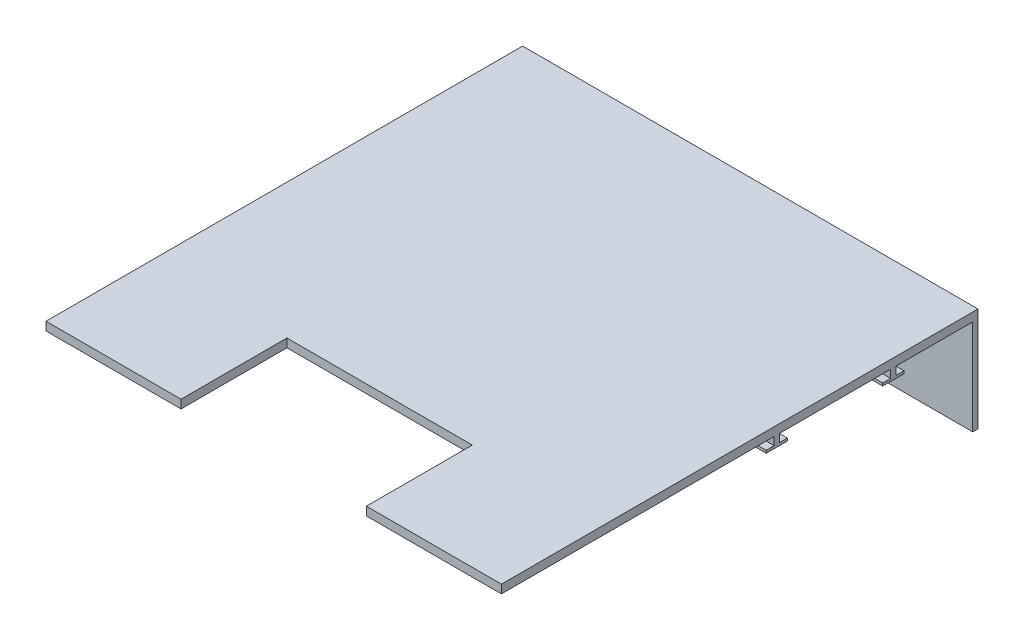
ISO-10303-21;
HEADER;
FILE_DESCRIPTION(('STEP AP214'),'2;1');
FILE_NAME('part.step','',(''),(''),'','','');
FILE_SCHEMA(('AUTOMOTIVE_DESIGN { 1 0 10303 214 1 1 1 1 }'));
ENDSEC;
DATA;
#1=APPLICATION_CONTEXT('core data for automotive mechanical design processes');
#2=APPLICATION_PROTOCOL_DEFINITION('international standard','automotive_design',2000,#1);
#3=PRODUCT_CONTEXT('',#1,'mechanical');
#4=PRODUCT('Part','Part','',(#3));
#5=PRODUCT_RELATED_PRODUCT_CATEGORY('part','',(#4));
#6=PRODUCT_DEFINITION_FORMATION('','',#4);
#7=PRODUCT_DEFINITION_CONTEXT('part definition',#1,'design');
#8=PRODUCT_DEFINITION('design','',#6,#7);
#9=PRODUCT_DEFINITION_SHAPE('','',#8);
#10=(LENGTH_UNIT() NAMED_UNIT(*) SI_UNIT(.MILLI.,.METRE.));
#11=(NAMED_UNIT(*) PLANE_ANGLE_UNIT() SI_UNIT($,.RADIAN.));
#12=(NAMED_UNIT(*) SI_UNIT($,.STERADIAN.) SOLID_ANGLE_UNIT());
#13=UNCERTAINTY_MEASURE_WITH_UNIT(LENGTH_MEASURE(1.E-05),#10,'distance_accuracy_value','');
#14=(GEOMETRIC_REPRESENTATION_CONTEXT(3) GLOBAL_UNCERTAINTY_ASSIGNED_CONTEXT((#13)) GLOBAL_UNIT_ASSIGNED_CONTEXT((#10,
#11,#12)) REPRESENTATION_CONTEXT('',''));
#15=CARTESIAN_POINT('',(0.,0.,0.));
#16=DIRECTION('',(0.,0.,1.));
#17=DIRECTION('',(1.,0.,0.));
#18=AXIS2_PLACEMENT_3D('',#15,#16,#17);
#19=CARTESIAN_POINT('',(0.,0.,0.));
#20=DIRECTION('',(0.,-1.,0.));
#21=DIRECTION('',(0.,0.,-1.));
#22=AXIS2_PLACEMENT_3D('',#19,#20,#21);
#23=PLANE('',#22);
#24=DIRECTION('',(-1.,0.,0.));
#25=VECTOR('',#24,1.);
#26=CARTESIAN_POINT('',(0.,0.,-262.5));
#27=LINE('',#26,#25);
#28=CARTESIAN_POINT('',(430.,0.,-262.5));
#29=VERTEX_POINT('',#28);
#30=CARTESIAN_POINT('',(0.,0.,-262.5));
#31=VERTEX_POINT('',#30);
#32=EDGE_CURVE('E50',#29,#31,#27,.T.);
#33=ORIENTED_EDGE('',*,*,#32,.T.);
#34=DIRECTION('',(0.,0.,1.));
#35=VECTOR('',#34,1.);
#36=CARTESIAN_POINT('',(0.,0.,0.));
#37=LINE('',#36,#35);
#38=CARTESIAN_POINT('',(0.,0.,-367.5));
#39=VERTEX_POINT('',#38);
#40=EDGE_CURVE('E388',#39,#31,#37,.T.);
#41=ORIENTED_EDGE('',*,*,#40,.F.);
#42=DIRECTION('',(-1.,0.,0.));
#43=VECTOR('',#42,1.);
#44=CARTESIAN_POINT('',(0.,0.,-367.5));
#45=LINE('',#44,#43);
#46=CARTESIAN_POINT('',(430.,0.,-367.5));
#47=VERTEX_POINT('',#46);
#48=EDGE_CURVE('E308',#47,#39,#45,.T.);
#49=ORIENTED_EDGE('',*,*,#48,.F.);
#50=DIRECTION('',(0.,0.,-1.));
#51=VECTOR('',#50,1.);
#52=CARTESIAN_POINT('',(430.,0.,0.));
#53=LINE('',#52,#51);
#54=EDGE_CURVE('E394',#29,#47,#53,.T.);
#55=ORIENTED_EDGE('',*,*,#54,.F.);
#56=EDGE_LOOP('',(#33,#41,#49,#55));
#57=FACE_BOUND('',#56,.T.);
#58=ADVANCED_FACE('F35',(#57),#23,.T.);
#59=CARTESIAN_POINT('',(430.,0.,-372.5));
#60=VERTEX_POINT('',#59);
#61=CARTESIAN_POINT('',(430.,0.,-445.));
#62=VERTEX_POINT('',#61);
#63=EDGE_CURVE('E392',#60,#62,#53,.T.);
#64=ORIENTED_EDGE('',*,*,#63,.F.);
#65=DIRECTION('',(1.,0.,0.));
#66=VECTOR('',#65,1.);
#67=CARTESIAN_POINT('',(0.,0.,-372.5));
#68=LINE('',#67,#66);
#69=CARTESIAN_POINT('',(0.,0.,-372.5));
#70=VERTEX_POINT('',#69);
#71=EDGE_CURVE('E303',#70,#60,#68,.T.);
#72=ORIENTED_EDGE('',*,*,#71,.F.);
#73=CARTESIAN_POINT('',(0.,0.,-445.));
#74=VERTEX_POINT('',#73);
#75=EDGE_CURVE('E384',#74,#70,#37,.T.);
#76=ORIENTED_EDGE('',*,*,#75,.F.);
#77=DIRECTION('',(-1.,0.,0.));
#78=VECTOR('',#77,1.);
#79=CARTESIAN_POINT('',(5.00062614380899,0.,-445.));
#80=LINE('',#79,#78);
#81=EDGE_CURVE('E322',#62,#74,#80,.T.);
#82=ORIENTED_EDGE('',*,*,#81,.F.);
#83=EDGE_LOOP('',(#64,#72,#76,#82));
#84=FACE_BOUND('',#83,.T.);
#85=ADVANCED_FACE('F457',(#84),#23,.T.);
#86=DIRECTION('',(1.,0.,0.));
#87=VECTOR('',#86,1.);
#88=CARTESIAN_POINT('',(0.,0.,-257.5));
#89=LINE('',#88,#87);
#90=CARTESIAN_POINT('',(0.,0.,-257.5));
#91=VERTEX_POINT('',#90);
#92=CARTESIAN_POINT('',(430.,0.,-257.5));
#93=VERTEX_POINT('',#92);
#94=EDGE_CURVE('E257',#91,#93,#89,.T.);
#95=ORIENTED_EDGE('',*,*,#94,.T.);
#96=CARTESIAN_POINT('',(430.,0.,0.));
#97=VERTEX_POINT('',#96);
#98=EDGE_CURVE('E375',#97,#93,#53,.T.);
#99=ORIENTED_EDGE('',*,*,#98,.F.);
#100=DIRECTION('',(1.,0.,0.));
#101=VECTOR('',#100,1.);
#102=CARTESIAN_POINT('',(0.,0.,0.));
#103=LINE('',#102,#101);
#104=CARTESIAN_POINT('',(302.5,0.,0.));
#105=VERTEX_POINT('',#104);
#106=EDGE_CURVE('E387',#105,#97,#103,.T.);
#107=ORIENTED_EDGE('',*,*,#106,.F.);
#108=DIRECTION('',(0.,0.,1.));
#109=VECTOR('',#108,1.);
#110=CARTESIAN_POINT('',(302.5,0.,0.));
#111=LINE('',#110,#109);
#112=CARTESIAN_POINT('',(302.5,0.,-100.));
#113=VERTEX_POINT('',#112);
#114=EDGE_CURVE('E404',#113,#105,#111,.T.);
#115=ORIENTED_EDGE('',*,*,#114,.F.);
#116=DIRECTION('',(1.,0.,0.));
#117=VECTOR('',#116,1.);
#118=CARTESIAN_POINT('',(0.,0.,-100.));
#119=LINE('',#118,#117);
#120=CARTESIAN_POINT('',(127.5,0.,-100.));
#121=VERTEX_POINT('',#120);
#122=EDGE_CURVE('E43',#121,#113,#119,.T.);
#123=ORIENTED_EDGE('',*,*,#122,.F.);
#124=DIRECTION('',(0.,0.,-1.));
#125=VECTOR('',#124,1.);
#126=CARTESIAN_POINT('',(127.5,0.,0.));
#127=LINE('',#126,#125);
#128=CARTESIAN_POINT('',(127.5,0.,0.));
#129=VERTEX_POINT('',#128);
#130=EDGE_CURVE('E11',#129,#121,#127,.T.);
#131=ORIENTED_EDGE('',*,*,#130,.F.);
#132=CARTESIAN_POINT('',(0.,0.,0.));
#133=VERTEX_POINT('',#132);
#134=EDGE_CURVE('E389',#133,#129,#103,.T.);
#135=ORIENTED_EDGE('',*,*,#134,.F.);
#136=EDGE_CURVE('E364',#91,#133,#37,.T.);
#137=ORIENTED_EDGE('',*,*,#136,.F.);
#138=EDGE_LOOP('',(#95,#99,#107,#115,#123,#131,#135,#137));
#139=FACE_BOUND('',#138,.T.);
#140=CARTESIAN_POINT('',(400.,0.,-217.));
#141=DIRECTION('',(0.,-1.,0.));
#142=DIRECTION('',(0.,0.,1.));
#143=AXIS2_PLACEMENT_3D('',#140,#141,#142);
#144=CIRCLE('',#143,3.49999999999996);
#145=CARTESIAN_POINT('',(400.,0.,-213.5));
#146=VERTEX_POINT('',#145);
#147=EDGE_CURVE('E341',#146,#146,#144,.T.);
#148=ORIENTED_EDGE('',*,*,#147,.F.);
#149=EDGE_LOOP('',(#148));
#150=FACE_BOUND('',#149,.T.);
#151=CARTESIAN_POINT('',(30.,0.,-217.));
#152=DIRECTION('',(0.,-1.,0.));
#153=DIRECTION('',(0.,0.,-1.));
#154=AXIS2_PLACEMENT_3D('',#151,#152,#153);
#155=CIRCLE('',#154,3.5);
#156=CARTESIAN_POINT('',(30.,0.,-220.5));
#157=VERTEX_POINT('',#156);
#158=EDGE_CURVE('E345',#157,#157,#155,.T.);
#159=ORIENTED_EDGE('',*,*,#158,.F.);
#160=EDGE_LOOP('',(#159));
#161=FACE_BOUND('',#160,.T.);
#162=ADVANCED_FACE('F414',(#139,#150,#161),#23,.T.);
#163=CARTESIAN_POINT('',(0.,8.,0.));
#164=DIRECTION('',(0.,0.,-1.));
#165=DIRECTION('',(-1.,0.,0.));
#166=AXIS2_PLACEMENT_3D('',#163,#164,#165);
#167=PLANE('',#166);
#168=ORIENTED_EDGE('',*,*,#134,.T.);
#169=DIRECTION('',(0.,1.,0.));
#170=VECTOR('',#169,1.);
#171=CARTESIAN_POINT('',(127.5,-2.,0.));
#172=LINE('',#171,#170);
#173=CARTESIAN_POINT('',(127.5,8.,0.));
#174=VERTEX_POINT('',#173);
#175=EDGE_CURVE('E361',#129,#174,#172,.T.);
#176=ORIENTED_EDGE('',*,*,#175,.T.);
#177=DIRECTION('',(1.,0.,0.));
#178=VECTOR('',#177,1.);
#179=CARTESIAN_POINT('',(0.,8.,0.));
#180=LINE('',#179,#178);
#181=CARTESIAN_POINT('',(0.,8.,0.));
#182=VERTEX_POINT('',#181);
#183=EDGE_CURVE('E376',#182,#174,#180,.T.);
#184=ORIENTED_EDGE('',*,*,#183,.F.);
#185=DIRECTION('',(0.,-1.,0.));
#186=VECTOR('',#185,1.);
#187=CARTESIAN_POINT('',(0.,8.,0.));
#188=LINE('',#187,#186);
#189=EDGE_CURVE('E401',#182,#133,#188,.T.);
#190=ORIENTED_EDGE('',*,*,#189,.T.);
#191=EDGE_LOOP('',(#168,#176,#184,#190));
#192=FACE_BOUND('',#191,.T.);
#193=ADVANCED_FACE('F434',(#192),#167,.F.);
#194=CARTESIAN_POINT('',(0.,8.,0.));
#195=DIRECTION('',(1.,0.,0.));
#196=DIRECTION('',(0.,0.,-1.));
#197=AXIS2_PLACEMENT_3D('',#194,#195,#196);
#198=PLANE('',#197);
#199=DIRECTION('',(0.,-1.,0.));
#200=VECTOR('',#199,1.);
#201=CARTESIAN_POINT('',(0.,8.,-450.));
#202=LINE('',#201,#200);
#203=CARTESIAN_POINT('',(0.,8.,-450.));
#204=VERTEX_POINT('',#203);
#205=CARTESIAN_POINT('',(0.,-90.,-450.));
#206=VERTEX_POINT('',#205);
#207=EDGE_CURVE('E383',#204,#206,#202,.T.);
#208=ORIENTED_EDGE('',*,*,#207,.T.);
#209=DIRECTION('',(0.,0.,-1.));
#210=VECTOR('',#209,1.);
#211=CARTESIAN_POINT('',(0.,-90.,-445.));
#212=LINE('',#211,#210);
#213=CARTESIAN_POINT('',(0.,-90.,-445.));
#214=VERTEX_POINT('',#213);
#215=EDGE_CURVE('E328',#214,#206,#212,.T.);
#216=ORIENTED_EDGE('',*,*,#215,.F.);
#217=DIRECTION('',(0.,1.,0.));
#218=VECTOR('',#217,1.);
#219=CARTESIAN_POINT('',(0.,-90.,-445.));
#220=LINE('',#219,#218);
#221=EDGE_CURVE('E334',#214,#74,#220,.T.);
#222=ORIENTED_EDGE('',*,*,#221,.T.);
#223=ORIENTED_EDGE('',*,*,#75,.T.);
#224=DIRECTION('',(0.,1.,0.));
#225=VECTOR('',#224,1.);
#226=CARTESIAN_POINT('',(0.,-7.5,-372.5));
#227=LINE('',#226,#225);
#228=CARTESIAN_POINT('',(0.,-7.5,-372.5));
#229=VERTEX_POINT('',#228);
#230=EDGE_CURVE('E320',#229,#70,#227,.T.);
#231=ORIENTED_EDGE('',*,*,#230,.F.);
#232=DIRECTION('',(0.,0.,-1.));
#233=VECTOR('',#232,1.);
#234=CARTESIAN_POINT('',(0.,-7.5,-360.));
#235=LINE('',#234,#233);
#236=CARTESIAN_POINT('',(0.,-7.5,-380.));
#237=VERTEX_POINT('',#236);
#238=EDGE_CURVE('E287',#229,#237,#235,.T.);
#239=ORIENTED_EDGE('',*,*,#238,.T.);
#240=DIRECTION('',(0.,1.,0.));
#241=VECTOR('',#240,1.);
#242=CARTESIAN_POINT('',(0.,-10.,-380.));
#243=LINE('',#242,#241);
#244=CARTESIAN_POINT('',(0.,-10.,-380.));
#245=VERTEX_POINT('',#244);
#246=EDGE_CURVE('E294',#245,#237,#243,.T.);
#247=ORIENTED_EDGE('',*,*,#246,.F.);
#248=DIRECTION('',(0.,0.,-1.));
#249=VECTOR('',#248,1.);
#250=CARTESIAN_POINT('',(0.,-10.,-360.));
#251=LINE('',#250,#249);
#252=CARTESIAN_POINT('',(0.,-10.,-360.));
#253=VERTEX_POINT('',#252);
#254=EDGE_CURVE('E278',#253,#245,#251,.T.);
#255=ORIENTED_EDGE('',*,*,#254,.F.);
#256=DIRECTION('',(0.,1.,0.));
#257=VECTOR('',#256,1.);
#258=CARTESIAN_POINT('',(0.,-10.,-360.));
#259=LINE('',#258,#257);
#260=CARTESIAN_POINT('',(0.,-7.5,-360.));
#261=VERTEX_POINT('',#260);
#262=EDGE_CURVE('E297',#253,#261,#259,.T.);
#263=ORIENTED_EDGE('',*,*,#262,.T.);
#264=CARTESIAN_POINT('',(0.,-7.5,-367.5));
#265=VERTEX_POINT('',#264);
#266=EDGE_CURVE('E288',#261,#265,#235,.T.);
#267=ORIENTED_EDGE('',*,*,#266,.T.);
#268=DIRECTION('',(0.,1.,0.));
#269=VECTOR('',#268,1.);
#270=CARTESIAN_POINT('',(0.,-7.5,-367.5));
#271=LINE('',#270,#269);
#272=EDGE_CURVE('E311',#265,#39,#271,.T.);
#273=ORIENTED_EDGE('',*,*,#272,.T.);
#274=ORIENTED_EDGE('',*,*,#40,.T.);
#275=DIRECTION('',(0.,1.,0.));
#276=VECTOR('',#275,1.);
#277=CARTESIAN_POINT('',(0.,-7.5,-262.5));
#278=LINE('',#277,#276);
#279=CARTESIAN_POINT('',(0.,-7.5,-262.5));
#280=VERTEX_POINT('',#279);
#281=EDGE_CURVE('E269',#280,#31,#278,.T.);
#282=ORIENTED_EDGE('',*,*,#281,.F.);
#283=DIRECTION('',(0.,0.,1.));
#284=VECTOR('',#283,1.);
#285=CARTESIAN_POINT('',(0.,-7.5,-270.));
#286=LINE('',#285,#284);
#287=CARTESIAN_POINT('',(0.,-7.5,-270.));
#288=VERTEX_POINT('',#287);
#289=EDGE_CURVE('E245',#288,#280,#286,.T.);
#290=ORIENTED_EDGE('',*,*,#289,.F.);
#291=DIRECTION('',(0.,1.,0.));
#292=VECTOR('',#291,1.);
#293=CARTESIAN_POINT('',(0.,-10.,-270.));
#294=LINE('',#293,#292);
#295=CARTESIAN_POINT('',(0.,-10.,-270.));
#296=VERTEX_POINT('',#295);
#297=EDGE_CURVE('E250',#296,#288,#294,.T.);
#298=ORIENTED_EDGE('',*,*,#297,.F.);
#299=DIRECTION('',(0.,0.,1.));
#300=VECTOR('',#299,1.);
#301=CARTESIAN_POINT('',(0.,-10.,-270.));
#302=LINE('',#301,#300);
#303=CARTESIAN_POINT('',(0.,-10.,-250.));
#304=VERTEX_POINT('',#303);
#305=EDGE_CURVE('E234',#296,#304,#302,.T.);
#306=ORIENTED_EDGE('',*,*,#305,.T.);
#307=DIRECTION('',(0.,1.,0.));
#308=VECTOR('',#307,1.);
#309=CARTESIAN_POINT('',(0.,-10.,-250.));
#310=LINE('',#309,#308);
#311=CARTESIAN_POINT('',(0.,-7.5,-250.));
#312=VERTEX_POINT('',#311);
#313=EDGE_CURVE('E220',#304,#312,#310,.T.);
#314=ORIENTED_EDGE('',*,*,#313,.T.);
#315=CARTESIAN_POINT('',(0.,-7.5,-257.5));
#316=VERTEX_POINT('',#315);
#317=EDGE_CURVE('E244',#316,#312,#286,.T.);
#318=ORIENTED_EDGE('',*,*,#317,.F.);
#319=DIRECTION('',(0.,1.,0.));
#320=VECTOR('',#319,1.);
#321=CARTESIAN_POINT('',(0.,-7.5,-257.5));
#322=LINE('',#321,#320);
#323=EDGE_CURVE('E260',#316,#91,#322,.T.);
#324=ORIENTED_EDGE('',*,*,#323,.T.);
#325=ORIENTED_EDGE('',*,*,#136,.T.);
#326=ORIENTED_EDGE('',*,*,#189,.F.);
#327=DIRECTION('',(0.,0.,1.));
#328=VECTOR('',#327,1.);
#329=CARTESIAN_POINT('',(0.,8.,0.));
#330=LINE('',#329,#328);
#331=EDGE_CURVE('E371',#204,#182,#330,.T.);
#332=ORIENTED_EDGE('',*,*,#331,.F.);
#333=EDGE_LOOP('',(#208,#216,#222,#223,#231,#239,#247,#255,#263,#267,#273,#274,#282,#290,#298,
#306,#314,#318,#324,#325,#326,#332));
#334=FACE_BOUND('',#333,.T.);
#335=ADVANCED_FACE('F37',(#334),#198,.F.);
#336=CARTESIAN_POINT('',(302.5,8.,0.));
#337=VERTEX_POINT('',#336);
#338=CARTESIAN_POINT('',(430.,8.,0.));
#339=VERTEX_POINT('',#338);
#340=EDGE_CURVE('E374',#337,#339,#180,.T.);
#341=ORIENTED_EDGE('',*,*,#340,.F.);
#342=DIRECTION('',(0.,1.,0.));
#343=VECTOR('',#342,1.);
#344=CARTESIAN_POINT('',(302.5,-2.,0.));
#345=LINE('',#344,#343);
#346=EDGE_CURVE('E367',#105,#337,#345,.T.);
#347=ORIENTED_EDGE('',*,*,#346,.F.);
#348=ORIENTED_EDGE('',*,*,#106,.T.);
#349=DIRECTION('',(0.,-1.,0.));
#350=VECTOR('',#349,1.);
#351=CARTESIAN_POINT('',(430.,8.,0.));
#352=LINE('',#351,#350);
#353=EDGE_CURVE('E398',#339,#97,#352,.T.);
#354=ORIENTED_EDGE('',*,*,#353,.F.);
#355=EDGE_LOOP('',(#341,#347,#348,#354));
#356=FACE_BOUND('',#355,.T.);
#357=ADVANCED_FACE('F423',(#356),#167,.F.);
#358=CARTESIAN_POINT('',(430.,8.,0.));
#359=DIRECTION('',(-1.,0.,0.));
#360=DIRECTION('',(0.,0.,1.));
#361=AXIS2_PLACEMENT_3D('',#358,#359,#360);
#362=PLANE('',#361);
#363=ORIENTED_EDGE('',*,*,#98,.T.);
#364=DIRECTION('',(0.,1.,0.));
#365=VECTOR('',#364,1.);
#366=CARTESIAN_POINT('',(430.,-7.5,-257.5));
#367=LINE('',#366,#365);
#368=CARTESIAN_POINT('',(430.,-7.5,-257.5));
#369=VERTEX_POINT('',#368);
#370=EDGE_CURVE('E265',#369,#93,#367,.T.);
#371=ORIENTED_EDGE('',*,*,#370,.F.);
#372=DIRECTION('',(0.,0.,-1.));
#373=VECTOR('',#372,1.);
#374=CARTESIAN_POINT('',(430.,-7.5,-270.));
#375=LINE('',#374,#373);
#376=CARTESIAN_POINT('',(430.,-7.5,-250.));
#377=VERTEX_POINT('',#376);
#378=EDGE_CURVE('E215',#377,#369,#375,.T.);
#379=ORIENTED_EDGE('',*,*,#378,.F.);
#380=DIRECTION('',(0.,1.,0.));
#381=VECTOR('',#380,1.);
#382=CARTESIAN_POINT('',(430.,-10.,-250.));
#383=LINE('',#382,#381);
#384=CARTESIAN_POINT('',(430.,-10.,-250.));
#385=VERTEX_POINT('',#384);
#386=EDGE_CURVE('E207',#385,#377,#383,.T.);
#387=ORIENTED_EDGE('',*,*,#386,.F.);
#388=DIRECTION('',(0.,0.,-1.));
#389=VECTOR('',#388,1.);
#390=CARTESIAN_POINT('',(430.,-10.,-270.));
#391=LINE('',#390,#389);
#392=CARTESIAN_POINT('',(430.,-10.,-270.));
#393=VERTEX_POINT('',#392);
#394=EDGE_CURVE('E212',#385,#393,#391,.T.);
#395=ORIENTED_EDGE('',*,*,#394,.T.);
#396=DIRECTION('',(0.,1.,0.));
#397=VECTOR('',#396,1.);
#398=CARTESIAN_POINT('',(430.,-10.,-270.));
#399=LINE('',#398,#397);
#400=CARTESIAN_POINT('',(430.,-7.5,-270.));
#401=VERTEX_POINT('',#400);
#402=EDGE_CURVE('E239',#393,#401,#399,.T.);
#403=ORIENTED_EDGE('',*,*,#402,.T.);
#404=CARTESIAN_POINT('',(430.,-7.5,-262.5));
#405=VERTEX_POINT('',#404);
#406=EDGE_CURVE('E242',#405,#401,#375,.T.);
#407=ORIENTED_EDGE('',*,*,#406,.F.);
#408=DIRECTION('',(0.,1.,0.));
#409=VECTOR('',#408,1.);
#410=CARTESIAN_POINT('',(430.,-7.5,-262.5));
#411=LINE('',#410,#409);
#412=EDGE_CURVE('E267',#405,#29,#411,.T.);
#413=ORIENTED_EDGE('',*,*,#412,.T.);
#414=ORIENTED_EDGE('',*,*,#54,.T.);
#415=DIRECTION('',(0.,1.,0.));
#416=VECTOR('',#415,1.);
#417=CARTESIAN_POINT('',(430.,-7.5,-367.5));
#418=LINE('',#417,#416);
#419=CARTESIAN_POINT('',(430.,-7.5,-367.5));
#420=VERTEX_POINT('',#419);
#421=EDGE_CURVE('E316',#420,#47,#418,.T.);
#422=ORIENTED_EDGE('',*,*,#421,.F.);
#423=DIRECTION('',(0.,0.,1.));
#424=VECTOR('',#423,1.);
#425=CARTESIAN_POINT('',(430.,-7.5,-360.));
#426=LINE('',#425,#424);
#427=CARTESIAN_POINT('',(430.,-7.5,-360.));
#428=VERTEX_POINT('',#427);
#429=EDGE_CURVE('E271',#420,#428,#426,.T.);
#430=ORIENTED_EDGE('',*,*,#429,.T.);
#431=DIRECTION('',(0.,1.,0.));
#432=VECTOR('',#431,1.);
#433=CARTESIAN_POINT('',(430.,-10.,-360.));
#434=LINE('',#433,#432);
#435=CARTESIAN_POINT('',(430.,-10.,-360.));
#436=VERTEX_POINT('',#435);
#437=EDGE_CURVE('E300',#436,#428,#434,.T.);
#438=ORIENTED_EDGE('',*,*,#437,.F.);
#439=DIRECTION('',(0.,0.,1.));
#440=VECTOR('',#439,1.);
#441=CARTESIAN_POINT('',(430.,-10.,-360.));
#442=LINE('',#441,#440);
#443=CARTESIAN_POINT('',(430.,-10.,-380.));
#444=VERTEX_POINT('',#443);
#445=EDGE_CURVE('E272',#444,#436,#442,.T.);
#446=ORIENTED_EDGE('',*,*,#445,.F.);
#447=DIRECTION('',(0.,1.,0.));
#448=VECTOR('',#447,1.);
#449=CARTESIAN_POINT('',(430.,-10.,-380.));
#450=LINE('',#449,#448);
#451=CARTESIAN_POINT('',(430.,-7.5,-380.));
#452=VERTEX_POINT('',#451);
#453=EDGE_CURVE('E282',#444,#452,#450,.T.);
#454=ORIENTED_EDGE('',*,*,#453,.T.);
#455=CARTESIAN_POINT('',(430.,-7.5,-372.5));
#456=VERTEX_POINT('',#455);
#457=EDGE_CURVE('E283',#452,#456,#426,.T.);
#458=ORIENTED_EDGE('',*,*,#457,.T.);
#459=DIRECTION('',(0.,1.,0.));
#460=VECTOR('',#459,1.);
#461=CARTESIAN_POINT('',(430.,-7.5,-372.5));
#462=LINE('',#461,#460);
#463=EDGE_CURVE('E58',#456,#60,#462,.T.);
#464=ORIENTED_EDGE('',*,*,#463,.T.);
#465=ORIENTED_EDGE('',*,*,#63,.T.);
#466=DIRECTION('',(0.,1.,0.));
#467=VECTOR('',#466,1.);
#468=CARTESIAN_POINT('',(430.,-90.,-445.));
#469=LINE('',#468,#467);
#470=CARTESIAN_POINT('',(430.,-90.,-445.));
#471=VERTEX_POINT('',#470);
#472=EDGE_CURVE('E338',#471,#62,#469,.T.);
#473=ORIENTED_EDGE('',*,*,#472,.F.);
#474=DIRECTION('',(0.,0.,1.));
#475=VECTOR('',#474,1.);
#476=CARTESIAN_POINT('',(430.,-90.,-445.));
#477=LINE('',#476,#475);
#478=CARTESIAN_POINT('',(430.,-90.,-450.));
#479=VERTEX_POINT('',#478);
#480=EDGE_CURVE('E323',#479,#471,#477,.T.);
#481=ORIENTED_EDGE('',*,*,#480,.F.);
#482=DIRECTION('',(0.,-1.,0.));
#483=VECTOR('',#482,1.);
#484=CARTESIAN_POINT('',(430.,8.,-450.));
#485=LINE('',#484,#483);
#486=CARTESIAN_POINT('',(430.,8.,-450.));
#487=VERTEX_POINT('',#486);
#488=EDGE_CURVE('E396',#487,#479,#485,.T.);
#489=ORIENTED_EDGE('',*,*,#488,.F.);
#490=DIRECTION('',(0.,0.,-1.));
#491=VECTOR('',#490,1.);
#492=CARTESIAN_POINT('',(430.,8.,0.));
#493=LINE('',#492,#491);
#494=EDGE_CURVE('E379',#339,#487,#493,.T.);
#495=ORIENTED_EDGE('',*,*,#494,.F.);
#496=ORIENTED_EDGE('',*,*,#353,.T.);
#497=EDGE_LOOP('',(#363,#371,#379,#387,#395,#403,#407,#413,#414,#422,#430,#438,#446,#454,#458,
#464,#465,#473,#481,#489,#495,#496));
#498=FACE_BOUND('',#497,.T.);
#499=ADVANCED_FACE('F210',(#498),#362,.F.);
#500=CARTESIAN_POINT('',(0.,8.,-450.));
#501=DIRECTION('',(0.,0.,1.));
#502=DIRECTION('',(1.,0.,0.));
#503=AXIS2_PLACEMENT_3D('',#500,#501,#502);
#504=PLANE('',#503);
#505=ORIENTED_EDGE('',*,*,#488,.T.);
#506=DIRECTION('',(1.,0.,0.));
#507=VECTOR('',#506,1.);
#508=CARTESIAN_POINT('',(430.,-90.,-450.));
#509=LINE('',#508,#507);
#510=EDGE_CURVE('E331',#206,#479,#509,.T.);
#511=ORIENTED_EDGE('',*,*,#510,.F.);
#512=ORIENTED_EDGE('',*,*,#207,.F.);
#513=DIRECTION('',(-1.,0.,0.));
#514=VECTOR('',#513,1.);
#515=CARTESIAN_POINT('',(0.,8.,-450.));
#516=LINE('',#515,#514);
#517=EDGE_CURVE('E381',#487,#204,#516,.T.);
#518=ORIENTED_EDGE('',*,*,#517,.F.);
#519=EDGE_LOOP('',(#505,#511,#512,#518));
#520=FACE_BOUND('',#519,.T.);
#521=ADVANCED_FACE('F466',(#520),#504,.F.);
#522=CARTESIAN_POINT('',(0.,8.,0.));
#523=DIRECTION('',(0.,-1.,0.));
#524=DIRECTION('',(0.,0.,-1.));
#525=AXIS2_PLACEMENT_3D('',#522,#523,#524);
#526=PLANE('',#525);
#527=ORIENTED_EDGE('',*,*,#183,.T.);
#528=DIRECTION('',(0.,0.,1.));
#529=VECTOR('',#528,1.);
#530=CARTESIAN_POINT('',(127.5,8.,0.));
#531=LINE('',#530,#529);
#532=CARTESIAN_POINT('',(127.5,8.,-100.));
#533=VERTEX_POINT('',#532);
#534=EDGE_CURVE('E351',#533,#174,#531,.T.);
#535=ORIENTED_EDGE('',*,*,#534,.F.);
#536=DIRECTION('',(-1.,0.,0.));
#537=VECTOR('',#536,1.);
#538=CARTESIAN_POINT('',(127.5,8.,-100.));
#539=LINE('',#538,#537);
#540=CARTESIAN_POINT('',(302.5,8.,-100.));
#541=VERTEX_POINT('',#540);
#542=EDGE_CURVE('E358',#541,#533,#539,.T.);
#543=ORIENTED_EDGE('',*,*,#542,.F.);
#544=DIRECTION('',(0.,0.,-1.));
#545=VECTOR('',#544,1.);
#546=CARTESIAN_POINT('',(302.5,8.,0.));
#547=LINE('',#546,#545);
#548=EDGE_CURVE('E355',#337,#541,#547,.T.);
#549=ORIENTED_EDGE('',*,*,#548,.F.);
#550=ORIENTED_EDGE('',*,*,#340,.T.);
#551=ORIENTED_EDGE('',*,*,#494,.T.);
#552=ORIENTED_EDGE('',*,*,#517,.T.);
#553=ORIENTED_EDGE('',*,*,#331,.T.);
#554=EDGE_LOOP('',(#527,#535,#543,#549,#550,#551,#552,#553));
#555=FACE_BOUND('',#554,.T.);
#556=ADVANCED_FACE('F427',(#555),#526,.F.);
#557=CARTESIAN_POINT('',(127.5,-2.,0.));
#558=DIRECTION('',(-1.,0.,0.));
#559=DIRECTION('',(0.,0.,1.));
#560=AXIS2_PLACEMENT_3D('',#557,#558,#559);
#561=PLANE('',#560);
#562=ORIENTED_EDGE('',*,*,#130,.T.);
#563=DIRECTION('',(0.,1.,0.));
#564=VECTOR('',#563,1.);
#565=CARTESIAN_POINT('',(127.5,-2.,-100.));
#566=LINE('',#565,#564);
#567=EDGE_CURVE('E362',#121,#533,#566,.T.);
#568=ORIENTED_EDGE('',*,*,#567,.T.);
#569=ORIENTED_EDGE('',*,*,#534,.T.);
#570=ORIENTED_EDGE('',*,*,#175,.F.);
#571=EDGE_LOOP('',(#562,#568,#569,#570));
#572=FACE_BOUND('',#571,.T.);
#573=ADVANCED_FACE('F432',(#572),#561,.F.);
#574=CARTESIAN_POINT('',(127.5,-2.,-100.));
#575=DIRECTION('',(0.,0.,-1.));
#576=DIRECTION('',(-1.,0.,0.));
#577=AXIS2_PLACEMENT_3D('',#574,#575,#576);
#578=PLANE('',#577);
#579=ORIENTED_EDGE('',*,*,#122,.T.);
#580=DIRECTION('',(0.,1.,0.));
#581=VECTOR('',#580,1.);
#582=CARTESIAN_POINT('',(302.5,-2.,-100.));
#583=LINE('',#582,#581);
#584=EDGE_CURVE('E365',#113,#541,#583,.T.);
#585=ORIENTED_EDGE('',*,*,#584,.T.);
#586=ORIENTED_EDGE('',*,*,#542,.T.);
#587=ORIENTED_EDGE('',*,*,#567,.F.);
#588=EDGE_LOOP('',(#579,#585,#586,#587));
#589=FACE_BOUND('',#588,.T.);
#590=ADVANCED_FACE('F410',(#589),#578,.F.);
#591=CARTESIAN_POINT('',(302.5,-2.,0.));
#592=DIRECTION('',(1.,0.,0.));
#593=DIRECTION('',(0.,0.,-1.));
#594=AXIS2_PLACEMENT_3D('',#591,#592,#593);
#595=PLANE('',#594);
#596=ORIENTED_EDGE('',*,*,#114,.T.);
#597=ORIENTED_EDGE('',*,*,#346,.T.);
#598=ORIENTED_EDGE('',*,*,#548,.T.);
#599=ORIENTED_EDGE('',*,*,#584,.F.);
#600=EDGE_LOOP('',(#596,#597,#598,#599));
#601=FACE_BOUND('',#600,.T.);
#602=ADVANCED_FACE('F419',(#601),#595,.F.);
#603=CARTESIAN_POINT('',(30.,-15.,-217.));
#604=DIRECTION('',(0.,1.,0.));
#605=DIRECTION('',(0.,0.,1.));
#606=AXIS2_PLACEMENT_3D('',#603,#604,#605);
#607=CYLINDRICAL_SURFACE('',#606,3.5);
#608=CARTESIAN_POINT('',(30.,-15.,-217.));
#609=DIRECTION('',(0.,-1.,0.));
#610=DIRECTION('',(0.,0.,-1.));
#611=AXIS2_PLACEMENT_3D('',#608,#609,#610);
#612=CIRCLE('',#611,3.5);
#613=CARTESIAN_POINT('',(30.,-15.,-220.5));
#614=VERTEX_POINT('',#613);
#615=EDGE_CURVE('E348',#614,#614,#612,.T.);
#616=ORIENTED_EDGE('',*,*,#615,.F.);
#617=EDGE_LOOP('',(#616));
#618=FACE_BOUND('',#617,.T.);
#619=ORIENTED_EDGE('',*,*,#158,.T.);
#620=EDGE_LOOP('',(#619));
#621=FACE_BOUND('',#620,.T.);
#622=ADVANCED_FACE('F524',(#618,#621),#607,.T.);
#623=CARTESIAN_POINT('',(30.,-15.,-217.));
#624=DIRECTION('',(0.,-1.,0.));
#625=DIRECTION('',(0.,0.,-1.));
#626=AXIS2_PLACEMENT_3D('',#623,#624,#625);
#627=PLANE('',#626);
#628=ORIENTED_EDGE('',*,*,#615,.T.);
#629=EDGE_LOOP('',(#628));
#630=FACE_BOUND('',#629,.T.);
#631=ADVANCED_FACE('F529',(#630),#627,.T.);
#632=CARTESIAN_POINT('',(400.,-15.,-217.));
#633=DIRECTION('',(0.,1.,0.));
#634=DIRECTION('',(0.,0.,1.));
#635=AXIS2_PLACEMENT_3D('',#632,#633,#634);
#636=CYLINDRICAL_SURFACE('',#635,3.49999999999996);
#637=CARTESIAN_POINT('',(400.,-15.,-217.));
#638=DIRECTION('',(0.,-1.,0.));
#639=DIRECTION('',(0.,0.,1.));
#640=AXIS2_PLACEMENT_3D('',#637,#638,#639);
#641=CIRCLE('',#640,3.49999999999996);
#642=CARTESIAN_POINT('',(400.,-15.,-213.5));
#643=VERTEX_POINT('',#642);
#644=EDGE_CURVE('E342',#643,#643,#641,.T.);
#645=ORIENTED_EDGE('',*,*,#644,.F.);
#646=EDGE_LOOP('',(#645));
#647=FACE_BOUND('',#646,.T.);
#648=ORIENTED_EDGE('',*,*,#147,.T.);
#649=EDGE_LOOP('',(#648));
#650=FACE_BOUND('',#649,.T.);
#651=ADVANCED_FACE('F533',(#647,#650),#636,.T.);
#652=CARTESIAN_POINT('',(400.,-15.,-217.));
#653=DIRECTION('',(0.,1.,0.));
#654=DIRECTION('',(0.,0.,1.));
#655=AXIS2_PLACEMENT_3D('',#652,#653,#654);
#656=PLANE('',#655);
#657=ORIENTED_EDGE('',*,*,#644,.T.);
#658=EDGE_LOOP('',(#657));
#659=FACE_BOUND('',#658,.T.);
#660=ADVANCED_FACE('F537',(#659),#656,.F.);
#661=CARTESIAN_POINT('',(5.00062614380899,-90.,-445.));
#662=DIRECTION('',(0.,0.,-1.));
#663=DIRECTION('',(-1.,0.,0.));
#664=AXIS2_PLACEMENT_3D('',#661,#662,#663);
#665=PLANE('',#664);
#666=ORIENTED_EDGE('',*,*,#81,.T.);
#667=ORIENTED_EDGE('',*,*,#221,.F.);
#668=DIRECTION('',(-1.,0.,0.));
#669=VECTOR('',#668,1.);
#670=CARTESIAN_POINT('',(429.008283611941,-90.,-445.));
#671=LINE('',#670,#669);
#672=EDGE_CURVE('E326',#471,#214,#671,.T.);
#673=ORIENTED_EDGE('',*,*,#672,.F.);
#674=ORIENTED_EDGE('',*,*,#472,.T.);
#675=EDGE_LOOP('',(#666,#667,#673,#674));
#676=FACE_BOUND('',#675,.T.);
#677=ADVANCED_FACE('F454',(#676),#665,.F.);
#678=CARTESIAN_POINT('',(0.,-90.,0.));
#679=DIRECTION('',(0.,1.,0.));
#680=DIRECTION('',(0.,0.,1.));
#681=AXIS2_PLACEMENT_3D('',#678,#679,#680);
#682=PLANE('',#681);
#683=ORIENTED_EDGE('',*,*,#480,.T.);
#684=ORIENTED_EDGE('',*,*,#672,.T.);
#685=ORIENTED_EDGE('',*,*,#215,.T.);
#686=ORIENTED_EDGE('',*,*,#510,.T.);
#687=EDGE_LOOP('',(#683,#684,#685,#686));
#688=FACE_BOUND('',#687,.T.);
#689=ADVANCED_FACE('F464',(#688),#682,.F.);
#690=CARTESIAN_POINT('',(0.,-7.5,-372.5));
#691=DIRECTION('',(0.,0.,1.));
#692=DIRECTION('',(1.,0.,0.));
#693=AXIS2_PLACEMENT_3D('',#690,#691,#692);
#694=PLANE('',#693);
#695=ORIENTED_EDGE('',*,*,#71,.T.);
#696=ORIENTED_EDGE('',*,*,#463,.F.);
#697=DIRECTION('',(1.,0.,0.));
#698=VECTOR('',#697,1.);
#699=CARTESIAN_POINT('',(0.,-7.5,-372.5));
#700=LINE('',#699,#698);
#701=EDGE_CURVE('E304',#229,#456,#700,.T.);
#702=ORIENTED_EDGE('',*,*,#701,.F.);
#703=ORIENTED_EDGE('',*,*,#230,.T.);
#704=EDGE_LOOP('',(#695,#696,#702,#703));
#705=FACE_BOUND('',#704,.T.);
#706=ADVANCED_FACE('F546',(#705),#694,.F.);
#707=CARTESIAN_POINT('',(0.,-7.5,-367.5));
#708=DIRECTION('',(0.,0.,-1.));
#709=DIRECTION('',(-1.,0.,0.));
#710=AXIS2_PLACEMENT_3D('',#707,#708,#709);
#711=PLANE('',#710);
#712=ORIENTED_EDGE('',*,*,#48,.T.);
#713=ORIENTED_EDGE('',*,*,#272,.F.);
#714=DIRECTION('',(-1.,0.,0.));
#715=VECTOR('',#714,1.);
#716=CARTESIAN_POINT('',(0.,-7.5,-367.5));
#717=LINE('',#716,#715);
#718=EDGE_CURVE('E307',#420,#265,#717,.T.);
#719=ORIENTED_EDGE('',*,*,#718,.F.);
#720=ORIENTED_EDGE('',*,*,#421,.T.);
#721=EDGE_LOOP('',(#712,#713,#719,#720));
#722=FACE_BOUND('',#721,.T.);
#723=ADVANCED_FACE('F549',(#722),#711,.F.);
#724=CARTESIAN_POINT('',(0.,-7.5,0.));
#725=DIRECTION('',(0.,-1.,0.));
#726=DIRECTION('',(0.,0.,-1.));
#727=AXIS2_PLACEMENT_3D('',#724,#725,#726);
#728=PLANE('',#727);
#729=ORIENTED_EDGE('',*,*,#238,.F.);
#730=ORIENTED_EDGE('',*,*,#701,.T.);
#731=ORIENTED_EDGE('',*,*,#457,.F.);
#732=DIRECTION('',(1.,0.,0.));
#733=VECTOR('',#732,1.);
#734=CARTESIAN_POINT('',(0.,-7.5,-380.));
#735=LINE('',#734,#733);
#736=EDGE_CURVE('E276',#237,#452,#735,.T.);
#737=ORIENTED_EDGE('',*,*,#736,.F.);
#738=EDGE_LOOP('',(#729,#730,#731,#737));
#739=FACE_BOUND('',#738,.T.);
#740=ADVANCED_FACE('F553',(#739),#728,.F.);
#741=ORIENTED_EDGE('',*,*,#429,.F.);
#742=ORIENTED_EDGE('',*,*,#718,.T.);
#743=ORIENTED_EDGE('',*,*,#266,.F.);
#744=DIRECTION('',(-1.,0.,0.));
#745=VECTOR('',#744,1.);
#746=CARTESIAN_POINT('',(430.,-7.5,-360.));
#747=LINE('',#746,#745);
#748=EDGE_CURVE('E285',#428,#261,#747,.T.);
#749=ORIENTED_EDGE('',*,*,#748,.F.);
#750=EDGE_LOOP('',(#741,#742,#743,#749));
#751=FACE_BOUND('',#750,.T.);
#752=ADVANCED_FACE('F559',(#751),#728,.F.);
#753=CARTESIAN_POINT('',(430.,-10.,-360.));
#754=DIRECTION('',(0.,0.,-1.));
#755=DIRECTION('',(-1.,0.,0.));
#756=AXIS2_PLACEMENT_3D('',#753,#754,#755);
#757=PLANE('',#756);
#758=ORIENTED_EDGE('',*,*,#748,.T.);
#759=ORIENTED_EDGE('',*,*,#262,.F.);
#760=DIRECTION('',(-1.,0.,0.));
#761=VECTOR('',#760,1.);
#762=CARTESIAN_POINT('',(430.,-10.,-360.));
#763=LINE('',#762,#761);
#764=EDGE_CURVE('E275',#436,#253,#763,.T.);
#765=ORIENTED_EDGE('',*,*,#764,.F.);
#766=ORIENTED_EDGE('',*,*,#437,.T.);
#767=EDGE_LOOP('',(#758,#759,#765,#766));
#768=FACE_BOUND('',#767,.T.);
#769=ADVANCED_FACE('F555',(#768),#757,.F.);
#770=CARTESIAN_POINT('',(0.,-10.,-380.));
#771=DIRECTION('',(0.,0.,1.));
#772=DIRECTION('',(1.,0.,0.));
#773=AXIS2_PLACEMENT_3D('',#770,#771,#772);
#774=PLANE('',#773);
#775=ORIENTED_EDGE('',*,*,#736,.T.);
#776=ORIENTED_EDGE('',*,*,#453,.F.);
#777=DIRECTION('',(1.,0.,0.));
#778=VECTOR('',#777,1.);
#779=CARTESIAN_POINT('',(0.,-10.,-380.));
#780=LINE('',#779,#778);
#781=EDGE_CURVE('E280',#245,#444,#780,.T.);
#782=ORIENTED_EDGE('',*,*,#781,.F.);
#783=ORIENTED_EDGE('',*,*,#246,.T.);
#784=EDGE_LOOP('',(#775,#776,#782,#783));
#785=FACE_BOUND('',#784,.T.);
#786=ADVANCED_FACE('F558',(#785),#774,.F.);
#787=CARTESIAN_POINT('',(0.,-10.,0.));
#788=DIRECTION('',(0.,-1.,0.));
#789=DIRECTION('',(0.,0.,-1.));
#790=AXIS2_PLACEMENT_3D('',#787,#788,#789);
#791=PLANE('',#790);
#792=ORIENTED_EDGE('',*,*,#445,.T.);
#793=ORIENTED_EDGE('',*,*,#764,.T.);
#794=ORIENTED_EDGE('',*,*,#254,.T.);
#795=ORIENTED_EDGE('',*,*,#781,.T.);
#796=EDGE_LOOP('',(#792,#793,#794,#795));
#797=FACE_BOUND('',#796,.T.);
#798=ADVANCED_FACE('F563',(#797),#791,.T.);
#799=CARTESIAN_POINT('',(0.,-7.5,-262.5));
#800=DIRECTION('',(0.,0.,-1.));
#801=DIRECTION('',(-1.,0.,0.));
#802=AXIS2_PLACEMENT_3D('',#799,#800,#801);
#803=PLANE('',#802);
#804=ORIENTED_EDGE('',*,*,#32,.F.);
#805=ORIENTED_EDGE('',*,*,#412,.F.);
#806=DIRECTION('',(-1.,0.,0.));
#807=VECTOR('',#806,1.);
#808=CARTESIAN_POINT('',(0.,-7.5,-262.5));
#809=LINE('',#808,#807);
#810=EDGE_CURVE('E253',#405,#280,#809,.T.);
#811=ORIENTED_EDGE('',*,*,#810,.T.);
#812=ORIENTED_EDGE('',*,*,#281,.T.);
#813=EDGE_LOOP('',(#804,#805,#811,#812));
#814=FACE_BOUND('',#813,.T.);
#815=ADVANCED_FACE('F479',(#814),#803,.T.);
#816=CARTESIAN_POINT('',(0.,-7.5,-257.5));
#817=DIRECTION('',(0.,0.,1.));
#818=DIRECTION('',(1.,0.,0.));
#819=AXIS2_PLACEMENT_3D('',#816,#817,#818);
#820=PLANE('',#819);
#821=ORIENTED_EDGE('',*,*,#94,.F.);
#822=ORIENTED_EDGE('',*,*,#323,.F.);
#823=DIRECTION('',(1.,0.,0.));
#824=VECTOR('',#823,1.);
#825=CARTESIAN_POINT('',(0.,-7.5,-257.5));
#826=LINE('',#825,#824);
#827=EDGE_CURVE('E256',#316,#369,#826,.T.);
#828=ORIENTED_EDGE('',*,*,#827,.T.);
#829=ORIENTED_EDGE('',*,*,#370,.T.);
#830=EDGE_LOOP('',(#821,#822,#828,#829));
#831=FACE_BOUND('',#830,.T.);
#832=ADVANCED_FACE('F471',(#831),#820,.T.);
#833=CARTESIAN_POINT('',(0.,-7.5,-630.));
#834=DIRECTION('',(0.,-1.,0.));
#835=DIRECTION('',(0.,0.,1.));
#836=AXIS2_PLACEMENT_3D('',#833,#834,#835);
#837=PLANE('',#836);
#838=ORIENTED_EDGE('',*,*,#810,.F.);
#839=ORIENTED_EDGE('',*,*,#406,.T.);
#840=DIRECTION('',(-1.,0.,0.));
#841=VECTOR('',#840,1.);
#842=CARTESIAN_POINT('',(430.,-7.5,-270.));
#843=LINE('',#842,#841);
#844=EDGE_CURVE('E230',#401,#288,#843,.T.);
#845=ORIENTED_EDGE('',*,*,#844,.T.);
#846=ORIENTED_EDGE('',*,*,#289,.T.);
#847=EDGE_LOOP('',(#838,#839,#845,#846));
#848=FACE_BOUND('',#847,.T.);
#849=ADVANCED_FACE('F480',(#848),#837,.F.);
#850=CARTESIAN_POINT('',(0.,-10.,-250.));
#851=DIRECTION('',(0.,0.,1.));
#852=DIRECTION('',(1.,0.,0.));
#853=AXIS2_PLACEMENT_3D('',#850,#851,#852);
#854=PLANE('',#853);
#855=DIRECTION('',(1.,0.,0.));
#856=VECTOR('',#855,1.);
#857=CARTESIAN_POINT('',(0.,-7.5,-250.));
#858=LINE('',#857,#856);
#859=EDGE_CURVE('E241',#312,#377,#858,.T.);
#860=ORIENTED_EDGE('',*,*,#859,.F.);
#861=ORIENTED_EDGE('',*,*,#313,.F.);
#862=DIRECTION('',(1.,0.,0.));
#863=VECTOR('',#862,1.);
#864=CARTESIAN_POINT('',(0.,-10.,-250.));
#865=LINE('',#864,#863);
#866=EDGE_CURVE('E226',#304,#385,#865,.T.);
#867=ORIENTED_EDGE('',*,*,#866,.T.);
#868=ORIENTED_EDGE('',*,*,#386,.T.);
#869=EDGE_LOOP('',(#860,#861,#867,#868));
#870=FACE_BOUND('',#869,.T.);
#871=ADVANCED_FACE('F232',(#870),#854,.T.);
#872=CARTESIAN_POINT('',(430.,-10.,-270.));
#873=DIRECTION('',(0.,0.,-1.));
#874=DIRECTION('',(-1.,0.,0.));
#875=AXIS2_PLACEMENT_3D('',#872,#873,#874);
#876=PLANE('',#875);
#877=ORIENTED_EDGE('',*,*,#844,.F.);
#878=ORIENTED_EDGE('',*,*,#402,.F.);
#879=DIRECTION('',(-1.,0.,0.));
#880=VECTOR('',#879,1.);
#881=CARTESIAN_POINT('',(430.,-10.,-270.));
#882=LINE('',#881,#880);
#883=EDGE_CURVE('E229',#393,#296,#882,.T.);
#884=ORIENTED_EDGE('',*,*,#883,.T.);
#885=ORIENTED_EDGE('',*,*,#297,.T.);
#886=EDGE_LOOP('',(#877,#878,#884,#885));
#887=FACE_BOUND('',#886,.T.);
#888=ADVANCED_FACE('F476',(#887),#876,.T.);
#889=CARTESIAN_POINT('',(0.,-10.,-630.));
#890=DIRECTION('',(0.,-1.,0.));
#891=DIRECTION('',(0.,0.,1.));
#892=AXIS2_PLACEMENT_3D('',#889,#890,#891);
#893=PLANE('',#892);
#894=ORIENTED_EDGE('',*,*,#394,.F.);
#895=ORIENTED_EDGE('',*,*,#866,.F.);
#896=ORIENTED_EDGE('',*,*,#305,.F.);
#897=ORIENTED_EDGE('',*,*,#883,.F.);
#898=EDGE_LOOP('',(#894,#895,#896,#897));
#899=FACE_BOUND('',#898,.T.);
#900=ADVANCED_FACE('F224',(#899),#893,.T.);
#901=ORIENTED_EDGE('',*,*,#827,.F.);
#902=ORIENTED_EDGE('',*,*,#317,.T.);
#903=ORIENTED_EDGE('',*,*,#859,.T.);
#904=ORIENTED_EDGE('',*,*,#378,.T.);
#905=EDGE_LOOP('',(#901,#902,#903,#904));
#906=FACE_BOUND('',#905,.T.);
#907=ADVANCED_FACE('F473',(#906),#837,.F.);
#908=CLOSED_SHELL('',(#58,#85,#162,#193,#335,#357,#499,#521,#556,#573,#590,#602,#622,#631,#651,
#660,#677,#689,#706,#723,#740,#752,#769,#786,#798,#815,#832,#849,#871,#888,#900,#907));
#909=MANIFOLD_SOLID_BREP('B2',#908);
#910=ADVANCED_BREP_SHAPE_REPRESENTATION('',(#18,#909),#14);
#911=SHAPE_DEFINITION_REPRESENTATION(#9,#910);
ENDSEC;
END-ISO-10303-21;
